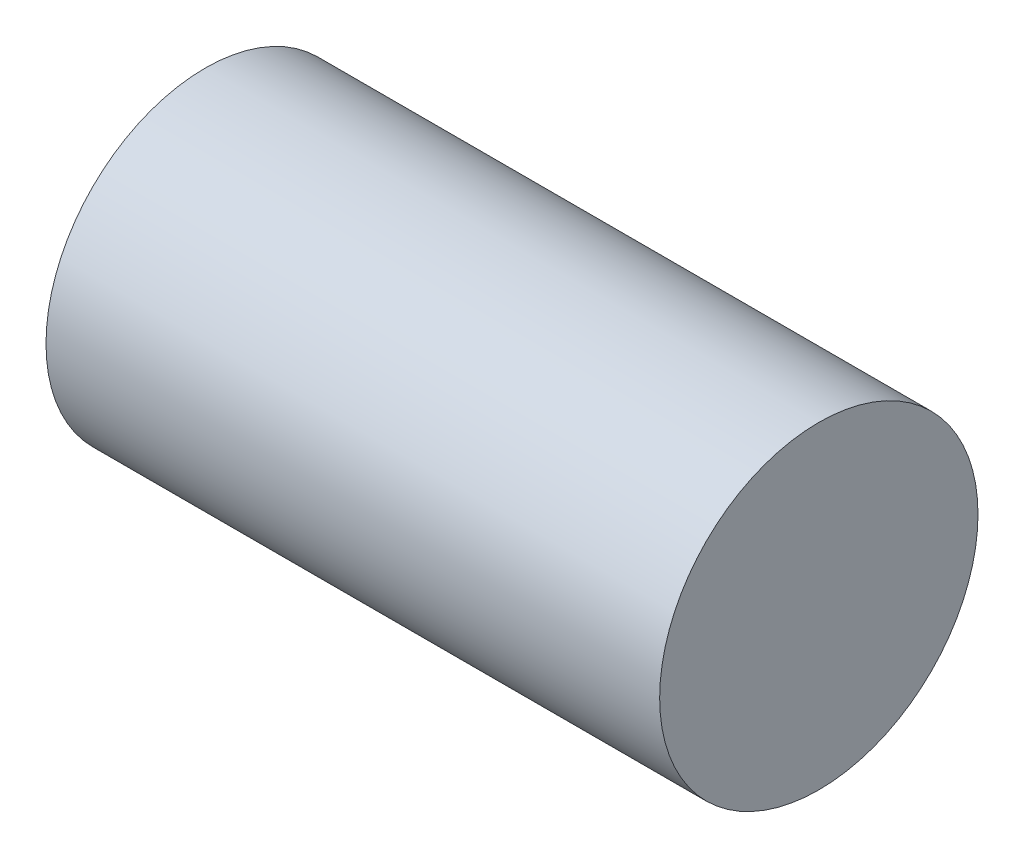
ISO-10303-21;
HEADER;
FILE_DESCRIPTION(('STEP AP214'),'2;1');
FILE_NAME('part.step','',(''),(''),'','','');
FILE_SCHEMA(('AUTOMOTIVE_DESIGN { 1 0 10303 214 1 1 1 1 }'));
ENDSEC;
DATA;
#1=APPLICATION_CONTEXT('core data for automotive mechanical design processes');
#2=APPLICATION_PROTOCOL_DEFINITION('international standard','automotive_design',2000,#1);
#3=PRODUCT_CONTEXT('',#1,'mechanical');
#4=PRODUCT('Part','Part','',(#3));
#5=PRODUCT_RELATED_PRODUCT_CATEGORY('part','',(#4));
#6=PRODUCT_DEFINITION_FORMATION('','',#4);
#7=PRODUCT_DEFINITION_CONTEXT('part definition',#1,'design');
#8=PRODUCT_DEFINITION('design','',#6,#7);
#9=PRODUCT_DEFINITION_SHAPE('','',#8);
#10=(LENGTH_UNIT() NAMED_UNIT(*) SI_UNIT(.MILLI.,.METRE.));
#11=(NAMED_UNIT(*) PLANE_ANGLE_UNIT() SI_UNIT($,.RADIAN.));
#12=(NAMED_UNIT(*) SI_UNIT($,.STERADIAN.) SOLID_ANGLE_UNIT());
#13=UNCERTAINTY_MEASURE_WITH_UNIT(LENGTH_MEASURE(1.E-05),#10,'distance_accuracy_value','');
#14=(GEOMETRIC_REPRESENTATION_CONTEXT(3) GLOBAL_UNCERTAINTY_ASSIGNED_CONTEXT((#13)) GLOBAL_UNIT_ASSIGNED_CONTEXT((#10,
#11,#12)) REPRESENTATION_CONTEXT('',''));
#15=CARTESIAN_POINT('',(0.,0.,0.));
#16=DIRECTION('',(0.,0.,1.));
#17=DIRECTION('',(1.,0.,0.));
#18=AXIS2_PLACEMENT_3D('',#15,#16,#17);
#19=CARTESIAN_POINT('',(24.,0.,0.));
#20=DIRECTION('',(-1.,0.,0.));
#21=DIRECTION('',(0.,0.,1.));
#22=AXIS2_PLACEMENT_3D('',#19,#20,#21);
#23=CYLINDRICAL_SURFACE('',#22,12.45);
#24=CARTESIAN_POINT('',(24.,0.,0.));
#25=DIRECTION('',(1.,0.,0.));
#26=DIRECTION('',(0.,0.,-1.));
#27=AXIS2_PLACEMENT_3D('',#24,#25,#26);
#28=CIRCLE('',#27,12.45);
#29=CARTESIAN_POINT('',(24.,0.,-12.45));
#30=VERTEX_POINT('',#29);
#31=EDGE_CURVE('E10',#30,#30,#28,.T.);
#32=ORIENTED_EDGE('',*,*,#31,.F.);
#33=EDGE_LOOP('',(#32));
#34=FACE_BOUND('',#33,.T.);
#35=CARTESIAN_POINT('',(-24.,0.,0.));
#36=DIRECTION('',(1.,0.,0.));
#37=DIRECTION('',(0.,0.,-1.));
#38=AXIS2_PLACEMENT_3D('',#35,#36,#37);
#39=CIRCLE('',#38,12.45);
#40=CARTESIAN_POINT('',(-24.,0.,-12.45));
#41=VERTEX_POINT('',#40);
#42=EDGE_CURVE('E40',#41,#41,#39,.T.);
#43=ORIENTED_EDGE('',*,*,#42,.T.);
#44=EDGE_LOOP('',(#43));
#45=FACE_BOUND('',#44,.T.);
#46=ADVANCED_FACE('F37',(#34,#45),#23,.T.);
#47=CARTESIAN_POINT('',(24.,0.,0.));
#48=DIRECTION('',(1.,0.,0.));
#49=DIRECTION('',(0.,0.,-1.));
#50=AXIS2_PLACEMENT_3D('',#47,#48,#49);
#51=PLANE('',#50);
#52=ORIENTED_EDGE('',*,*,#31,.T.);
#53=EDGE_LOOP('',(#52));
#54=FACE_BOUND('',#53,.T.);
#55=ADVANCED_FACE('F52',(#54),#51,.T.);
#56=CARTESIAN_POINT('',(-24.,0.,0.));
#57=DIRECTION('',(1.,0.,0.));
#58=DIRECTION('',(0.,0.,-1.));
#59=AXIS2_PLACEMENT_3D('',#56,#57,#58);
#60=PLANE('',#59);
#61=ORIENTED_EDGE('',*,*,#42,.F.);
#62=EDGE_LOOP('',(#61));
#63=FACE_BOUND('',#62,.T.);
#64=ADVANCED_FACE('F50',(#63),#60,.F.);
#65=CLOSED_SHELL('',(#46,#55,#64));
#66=MANIFOLD_SOLID_BREP('B2',#65);
#67=ADVANCED_BREP_SHAPE_REPRESENTATION('',(#18,#66),#14);
#68=SHAPE_DEFINITION_REPRESENTATION(#9,#67);
ENDSEC;
END-ISO-10303-21;
